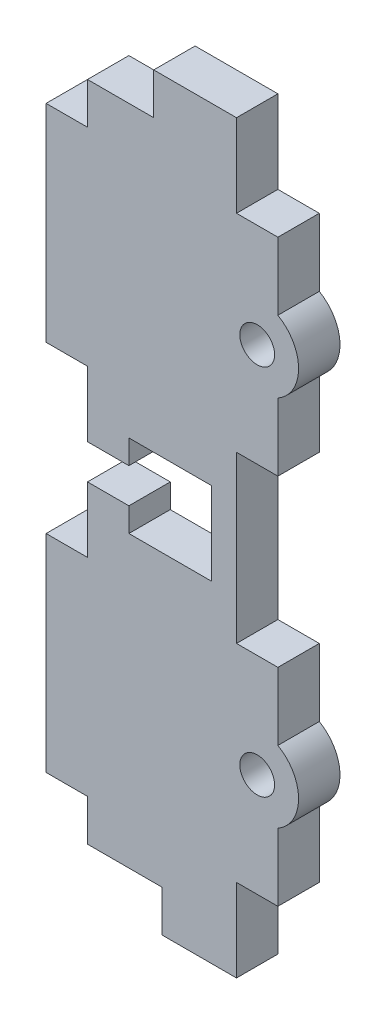
ISO-10303-21;
HEADER;
FILE_DESCRIPTION(('STEP AP214'),'2;1');
FILE_NAME('part.step','',(''),(''),'','','');
FILE_SCHEMA(('AUTOMOTIVE_DESIGN { 1 0 10303 214 1 1 1 1 }'));
ENDSEC;
DATA;
#1=APPLICATION_CONTEXT('core data for automotive mechanical design processes');
#2=APPLICATION_PROTOCOL_DEFINITION('international standard','automotive_design',2000,#1);
#3=PRODUCT_CONTEXT('',#1,'mechanical');
#4=PRODUCT('Part','Part','',(#3));
#5=PRODUCT_RELATED_PRODUCT_CATEGORY('part','',(#4));
#6=PRODUCT_DEFINITION_FORMATION('','',#4);
#7=PRODUCT_DEFINITION_CONTEXT('part definition',#1,'design');
#8=PRODUCT_DEFINITION('design','',#6,#7);
#9=PRODUCT_DEFINITION_SHAPE('','',#8);
#10=(LENGTH_UNIT() NAMED_UNIT(*) SI_UNIT(.MILLI.,.METRE.));
#11=(NAMED_UNIT(*) PLANE_ANGLE_UNIT() SI_UNIT($,.RADIAN.));
#12=(NAMED_UNIT(*) SI_UNIT($,.STERADIAN.) SOLID_ANGLE_UNIT());
#13=UNCERTAINTY_MEASURE_WITH_UNIT(LENGTH_MEASURE(1.E-05),#10,'distance_accuracy_value','');
#14=(GEOMETRIC_REPRESENTATION_CONTEXT(3) GLOBAL_UNCERTAINTY_ASSIGNED_CONTEXT((#13)) GLOBAL_UNIT_ASSIGNED_CONTEXT((#10,
#11,#12)) REPRESENTATION_CONTEXT('',''));
#15=CARTESIAN_POINT('',(0.,0.,0.));
#16=DIRECTION('',(0.,0.,1.));
#17=DIRECTION('',(1.,0.,0.));
#18=AXIS2_PLACEMENT_3D('',#15,#16,#17);
#19=CARTESIAN_POINT('',(-18.,0.,5.));
#20=DIRECTION('',(1.,0.,0.));
#21=DIRECTION('',(0.,0.,-1.));
#22=AXIS2_PLACEMENT_3D('',#19,#20,#21);
#23=PLANE('',#22);
#24=DIRECTION('',(0.,0.,1.));
#25=VECTOR('',#24,1.);
#26=CARTESIAN_POINT('',(-18.,42.1,0.));
#27=LINE('',#26,#25);
#28=CARTESIAN_POINT('',(-18.,42.1,0.));
#29=VERTEX_POINT('',#28);
#30=CARTESIAN_POINT('',(-18.,42.1,5.));
#31=VERTEX_POINT('',#30);
#32=EDGE_CURVE('E324',#29,#31,#27,.T.);
#33=ORIENTED_EDGE('',*,*,#32,.T.);
#34=DIRECTION('',(0.,-1.,0.));
#35=VECTOR('',#34,1.);
#36=CARTESIAN_POINT('',(-18.,0.,5.));
#37=LINE('',#36,#35);
#38=CARTESIAN_POINT('',(-18.,50.,5.));
#39=VERTEX_POINT('',#38);
#40=EDGE_CURVE('E529',#39,#31,#37,.T.);
#41=ORIENTED_EDGE('',*,*,#40,.F.);
#42=DIRECTION('',(0.,0.,-1.));
#43=VECTOR('',#42,1.);
#44=CARTESIAN_POINT('',(-18.,50.,5.));
#45=LINE('',#44,#43);
#46=CARTESIAN_POINT('',(-18.,50.,0.));
#47=VERTEX_POINT('',#46);
#48=EDGE_CURVE('E423',#39,#47,#45,.T.);
#49=ORIENTED_EDGE('',*,*,#48,.T.);
#50=DIRECTION('',(0.,-1.,0.));
#51=VECTOR('',#50,1.);
#52=CARTESIAN_POINT('',(-18.,0.,0.));
#53=LINE('',#52,#51);
#54=EDGE_CURVE('E542',#47,#29,#53,.T.);
#55=ORIENTED_EDGE('',*,*,#54,.T.);
#56=EDGE_LOOP('',(#33,#41,#49,#55));
#57=FACE_BOUND('',#56,.T.);
#58=ADVANCED_FACE('F34',(#57),#23,.F.);
#59=CARTESIAN_POINT('',(5.,4.99999999999999,5.));
#60=DIRECTION('',(1.,0.,0.));
#61=DIRECTION('',(0.,1.,0.));
#62=AXIS2_PLACEMENT_3D('',#59,#60,#61);
#63=PLANE('',#62);
#64=DIRECTION('',(0.,0.,-1.));
#65=VECTOR('',#64,1.);
#66=CARTESIAN_POINT('',(5.,13.1698729810778,5.));
#67=LINE('',#66,#65);
#68=CARTESIAN_POINT('',(5.,13.1698729810778,5.));
#69=VERTEX_POINT('',#68);
#70=CARTESIAN_POINT('',(5.,13.1698729810778,0.));
#71=VERTEX_POINT('',#70);
#72=EDGE_CURVE('E332',#69,#71,#67,.T.);
#73=ORIENTED_EDGE('',*,*,#72,.F.);
#74=DIRECTION('',(0.,-1.,0.));
#75=VECTOR('',#74,1.);
#76=CARTESIAN_POINT('',(5.,4.99999999999999,5.));
#77=LINE('',#76,#75);
#78=CARTESIAN_POINT('',(5.,4.99999999999999,5.));
#79=VERTEX_POINT('',#78);
#80=EDGE_CURVE('E459',#69,#79,#77,.T.);
#81=ORIENTED_EDGE('',*,*,#80,.T.);
#82=DIRECTION('',(0.,0.,-1.));
#83=VECTOR('',#82,1.);
#84=CARTESIAN_POINT('',(5.,4.99999999999999,5.));
#85=LINE('',#84,#83);
#86=CARTESIAN_POINT('',(5.,4.99999999999999,0.));
#87=VERTEX_POINT('',#86);
#88=EDGE_CURVE('E479',#79,#87,#85,.T.);
#89=ORIENTED_EDGE('',*,*,#88,.T.);
#90=DIRECTION('',(0.,-1.,0.));
#91=VECTOR('',#90,1.);
#92=CARTESIAN_POINT('',(5.,4.99999999999999,0.));
#93=LINE('',#92,#91);
#94=EDGE_CURVE('E470',#71,#87,#93,.T.);
#95=ORIENTED_EDGE('',*,*,#94,.F.);
#96=EDGE_LOOP('',(#73,#81,#89,#95));
#97=FACE_BOUND('',#96,.T.);
#98=ADVANCED_FACE('F636',(#97),#63,.T.);
#99=CARTESIAN_POINT('',(5.,75.,5.));
#100=DIRECTION('',(1.,0.,0.));
#101=DIRECTION('',(0.,1.,0.));
#102=AXIS2_PLACEMENT_3D('',#99,#100,#101);
#103=PLANE('',#102);
#104=DIRECTION('',(0.,0.,-1.));
#105=VECTOR('',#104,1.);
#106=CARTESIAN_POINT('',(5.,58.1698729810778,5.));
#107=LINE('',#106,#105);
#108=CARTESIAN_POINT('',(5.,58.1698729810778,5.));
#109=VERTEX_POINT('',#108);
#110=CARTESIAN_POINT('',(5.,58.1698729810778,0.));
#111=VERTEX_POINT('',#110);
#112=EDGE_CURVE('E341',#109,#111,#107,.T.);
#113=ORIENTED_EDGE('',*,*,#112,.F.);
#114=DIRECTION('',(0.,-1.,0.));
#115=VECTOR('',#114,1.);
#116=CARTESIAN_POINT('',(5.,75.,5.));
#117=LINE('',#116,#115);
#118=CARTESIAN_POINT('',(5.,50.,5.));
#119=VERTEX_POINT('',#118);
#120=EDGE_CURVE('E489',#109,#119,#117,.T.);
#121=ORIENTED_EDGE('',*,*,#120,.T.);
#122=DIRECTION('',(0.,0.,-1.));
#123=VECTOR('',#122,1.);
#124=CARTESIAN_POINT('',(5.,50.,5.));
#125=LINE('',#124,#123);
#126=CARTESIAN_POINT('',(5.,50.,0.));
#127=VERTEX_POINT('',#126);
#128=EDGE_CURVE('E510',#119,#127,#125,.T.);
#129=ORIENTED_EDGE('',*,*,#128,.T.);
#130=DIRECTION('',(0.,-1.,0.));
#131=VECTOR('',#130,1.);
#132=CARTESIAN_POINT('',(5.,75.,0.));
#133=LINE('',#132,#131);
#134=EDGE_CURVE('E500',#111,#127,#133,.T.);
#135=ORIENTED_EDGE('',*,*,#134,.F.);
#136=EDGE_LOOP('',(#113,#121,#129,#135));
#137=FACE_BOUND('',#136,.T.);
#138=ADVANCED_FACE('F618',(#137),#103,.T.);
#139=CARTESIAN_POINT('',(0.,0.,5.));
#140=DIRECTION('',(0.,1.,0.));
#141=DIRECTION('',(-1.,0.,0.));
#142=AXIS2_PLACEMENT_3D('',#139,#140,#141);
#143=PLANE('',#142);
#144=DIRECTION('',(0.,0.,-1.));
#145=VECTOR('',#144,1.);
#146=CARTESIAN_POINT('',(-9.,0.,0.));
#147=LINE('',#146,#145);
#148=CARTESIAN_POINT('',(-9.,0.,5.));
#149=VERTEX_POINT('',#148);
#150=CARTESIAN_POINT('',(-9.,0.,0.));
#151=VERTEX_POINT('',#150);
#152=EDGE_CURVE('E376',#149,#151,#147,.T.);
#153=ORIENTED_EDGE('',*,*,#152,.F.);
#154=DIRECTION('',(1.,0.,0.));
#155=VECTOR('',#154,1.);
#156=CARTESIAN_POINT('',(0.,0.,5.));
#157=LINE('',#156,#155);
#158=CARTESIAN_POINT('',(-18.,0.,5.));
#159=VERTEX_POINT('',#158);
#160=EDGE_CURVE('E528',#159,#149,#157,.T.);
#161=ORIENTED_EDGE('',*,*,#160,.F.);
#162=DIRECTION('',(0.,0.,-1.));
#163=VECTOR('',#162,1.);
#164=CARTESIAN_POINT('',(-18.,0.,5.));
#165=LINE('',#164,#163);
#166=CARTESIAN_POINT('',(-18.,0.,0.));
#167=VERTEX_POINT('',#166);
#168=EDGE_CURVE('E42',#159,#167,#165,.T.);
#169=ORIENTED_EDGE('',*,*,#168,.T.);
#170=DIRECTION('',(1.,0.,0.));
#171=VECTOR('',#170,1.);
#172=CARTESIAN_POINT('',(0.,0.,0.));
#173=LINE('',#172,#171);
#174=EDGE_CURVE('E541',#167,#151,#173,.T.);
#175=ORIENTED_EDGE('',*,*,#174,.T.);
#176=EDGE_LOOP('',(#153,#161,#169,#175));
#177=FACE_BOUND('',#176,.T.);
#178=ADVANCED_FACE('F549',(#177),#143,.F.);
#179=CARTESIAN_POINT('',(-18.,80.,0.));
#180=VERTEX_POINT('',#179);
#181=CARTESIAN_POINT('',(-18.,75.,0.));
#182=VERTEX_POINT('',#181);
#183=EDGE_CURVE('E539',#180,#182,#53,.T.);
#184=ORIENTED_EDGE('',*,*,#183,.T.);
#185=DIRECTION('',(0.,0.,-1.));
#186=VECTOR('',#185,1.);
#187=CARTESIAN_POINT('',(-18.,75.,5.));
#188=LINE('',#187,#186);
#189=CARTESIAN_POINT('',(-18.,75.,5.));
#190=VERTEX_POINT('',#189);
#191=EDGE_CURVE('E410',#190,#182,#188,.T.);
#192=ORIENTED_EDGE('',*,*,#191,.F.);
#193=CARTESIAN_POINT('',(-18.,80.,5.));
#194=VERTEX_POINT('',#193);
#195=EDGE_CURVE('E525',#194,#190,#37,.T.);
#196=ORIENTED_EDGE('',*,*,#195,.F.);
#197=DIRECTION('',(0.,0.,-1.));
#198=VECTOR('',#197,1.);
#199=CARTESIAN_POINT('',(-18.,80.,5.));
#200=LINE('',#199,#198);
#201=EDGE_CURVE('E11',#194,#180,#200,.T.);
#202=ORIENTED_EDGE('',*,*,#201,.T.);
#203=EDGE_LOOP('',(#184,#192,#196,#202));
#204=FACE_BOUND('',#203,.T.);
#205=ADVANCED_FACE('F587',(#204),#23,.F.);
#206=CARTESIAN_POINT('',(-18.,37.9,5.));
#207=VERTEX_POINT('',#206);
#208=CARTESIAN_POINT('',(-18.,30.,5.));
#209=VERTEX_POINT('',#208);
#210=EDGE_CURVE('E530',#207,#209,#37,.T.);
#211=ORIENTED_EDGE('',*,*,#210,.F.);
#212=DIRECTION('',(0.,0.,1.));
#213=VECTOR('',#212,1.);
#214=CARTESIAN_POINT('',(-18.,37.9,0.));
#215=LINE('',#214,#213);
#216=CARTESIAN_POINT('',(-18.,37.9,0.));
#217=VERTEX_POINT('',#216);
#218=EDGE_CURVE('E322',#217,#207,#215,.T.);
#219=ORIENTED_EDGE('',*,*,#218,.F.);
#220=CARTESIAN_POINT('',(-18.,30.,0.));
#221=VERTEX_POINT('',#220);
#222=EDGE_CURVE('E543',#217,#221,#53,.T.);
#223=ORIENTED_EDGE('',*,*,#222,.T.);
#224=DIRECTION('',(0.,0.,-1.));
#225=VECTOR('',#224,1.);
#226=CARTESIAN_POINT('',(-18.,30.,5.));
#227=LINE('',#226,#225);
#228=EDGE_CURVE('E450',#209,#221,#227,.T.);
#229=ORIENTED_EDGE('',*,*,#228,.F.);
#230=EDGE_LOOP('',(#211,#219,#223,#229));
#231=FACE_BOUND('',#230,.T.);
#232=ADVANCED_FACE('F647',(#231),#23,.F.);
#233=CARTESIAN_POINT('',(0.,0.,5.));
#234=DIRECTION('',(-1.,0.,0.));
#235=DIRECTION('',(0.,0.,1.));
#236=AXIS2_PLACEMENT_3D('',#233,#234,#235);
#237=PLANE('',#236);
#238=DIRECTION('',(0.,1.,0.));
#239=VECTOR('',#238,1.);
#240=CARTESIAN_POINT('',(0.,0.,0.));
#241=LINE('',#240,#239);
#242=CARTESIAN_POINT('',(0.,-5.,0.));
#243=VERTEX_POINT('',#242);
#244=CARTESIAN_POINT('',(0.,4.99999999999999,0.));
#245=VERTEX_POINT('',#244);
#246=EDGE_CURVE('E533',#243,#245,#241,.T.);
#247=ORIENTED_EDGE('',*,*,#246,.T.);
#248=DIRECTION('',(0.,0.,-1.));
#249=VECTOR('',#248,1.);
#250=CARTESIAN_POINT('',(0.,4.99999999999999,5.));
#251=LINE('',#250,#249);
#252=CARTESIAN_POINT('',(0.,4.99999999999999,5.));
#253=VERTEX_POINT('',#252);
#254=EDGE_CURVE('E475',#253,#245,#251,.T.);
#255=ORIENTED_EDGE('',*,*,#254,.F.);
#256=DIRECTION('',(0.,1.,0.));
#257=VECTOR('',#256,1.);
#258=CARTESIAN_POINT('',(0.,0.,5.));
#259=LINE('',#258,#257);
#260=CARTESIAN_POINT('',(0.,-5.,5.));
#261=VERTEX_POINT('',#260);
#262=EDGE_CURVE('E517',#261,#253,#259,.T.);
#263=ORIENTED_EDGE('',*,*,#262,.F.);
#264=DIRECTION('',(0.,0.,1.));
#265=VECTOR('',#264,1.);
#266=CARTESIAN_POINT('',(0.,-5.,0.));
#267=LINE('',#266,#265);
#268=EDGE_CURVE('E381',#243,#261,#267,.T.);
#269=ORIENTED_EDGE('',*,*,#268,.F.);
#270=EDGE_LOOP('',(#247,#255,#263,#269));
#271=FACE_BOUND('',#270,.T.);
#272=ADVANCED_FACE('F645',(#271),#237,.F.);
#273=CARTESIAN_POINT('',(0.,30.,5.));
#274=VERTEX_POINT('',#273);
#275=CARTESIAN_POINT('',(0.,50.,5.));
#276=VERTEX_POINT('',#275);
#277=EDGE_CURVE('E521',#274,#276,#259,.T.);
#278=ORIENTED_EDGE('',*,*,#277,.F.);
#279=DIRECTION('',(0.,0.,-1.));
#280=VECTOR('',#279,1.);
#281=CARTESIAN_POINT('',(0.,30.,5.));
#282=LINE('',#281,#280);
#283=CARTESIAN_POINT('',(0.,30.,0.));
#284=VERTEX_POINT('',#283);
#285=EDGE_CURVE('E467',#274,#284,#282,.T.);
#286=ORIENTED_EDGE('',*,*,#285,.T.);
#287=CARTESIAN_POINT('',(0.,50.,0.));
#288=VERTEX_POINT('',#287);
#289=EDGE_CURVE('E536',#284,#288,#241,.T.);
#290=ORIENTED_EDGE('',*,*,#289,.T.);
#291=DIRECTION('',(0.,0.,-1.));
#292=VECTOR('',#291,1.);
#293=CARTESIAN_POINT('',(0.,50.,5.));
#294=LINE('',#293,#292);
#295=EDGE_CURVE('E506',#276,#288,#294,.T.);
#296=ORIENTED_EDGE('',*,*,#295,.F.);
#297=EDGE_LOOP('',(#278,#286,#290,#296));
#298=FACE_BOUND('',#297,.T.);
#299=ADVANCED_FACE('F607',(#298),#237,.F.);
#300=CARTESIAN_POINT('',(0.,75.,5.));
#301=VERTEX_POINT('',#300);
#302=CARTESIAN_POINT('',(0.,85.,5.));
#303=VERTEX_POINT('',#302);
#304=EDGE_CURVE('E522',#301,#303,#259,.T.);
#305=ORIENTED_EDGE('',*,*,#304,.F.);
#306=DIRECTION('',(0.,0.,-1.));
#307=VECTOR('',#306,1.);
#308=CARTESIAN_POINT('',(0.,75.,5.));
#309=LINE('',#308,#307);
#310=CARTESIAN_POINT('',(0.,75.,0.));
#311=VERTEX_POINT('',#310);
#312=EDGE_CURVE('E497',#301,#311,#309,.T.);
#313=ORIENTED_EDGE('',*,*,#312,.T.);
#314=CARTESIAN_POINT('',(0.,85.,0.));
#315=VERTEX_POINT('',#314);
#316=EDGE_CURVE('E509',#311,#315,#241,.T.);
#317=ORIENTED_EDGE('',*,*,#316,.T.);
#318=DIRECTION('',(0.,0.,-1.));
#319=VECTOR('',#318,1.);
#320=CARTESIAN_POINT('',(0.,85.,5.));
#321=LINE('',#320,#319);
#322=EDGE_CURVE('E373',#303,#315,#321,.T.);
#323=ORIENTED_EDGE('',*,*,#322,.F.);
#324=EDGE_LOOP('',(#305,#313,#317,#323));
#325=FACE_BOUND('',#324,.T.);
#326=ADVANCED_FACE('F36',(#325),#237,.F.);
#327=CARTESIAN_POINT('',(0.,80.,5.));
#328=DIRECTION('',(0.,-1.,0.));
#329=DIRECTION('',(0.,0.,-1.));
#330=AXIS2_PLACEMENT_3D('',#327,#328,#329);
#331=PLANE('',#330);
#332=DIRECTION('',(-1.,0.,0.));
#333=VECTOR('',#332,1.);
#334=CARTESIAN_POINT('',(0.,80.,5.));
#335=LINE('',#334,#333);
#336=CARTESIAN_POINT('',(-10.,80.,5.));
#337=VERTEX_POINT('',#336);
#338=EDGE_CURVE('E520',#337,#194,#335,.T.);
#339=ORIENTED_EDGE('',*,*,#338,.F.);
#340=DIRECTION('',(0.,0.,-1.));
#341=VECTOR('',#340,1.);
#342=CARTESIAN_POINT('',(-10.,80.,5.));
#343=LINE('',#342,#341);
#344=CARTESIAN_POINT('',(-10.,80.,0.));
#345=VERTEX_POINT('',#344);
#346=EDGE_CURVE('E368',#337,#345,#343,.T.);
#347=ORIENTED_EDGE('',*,*,#346,.T.);
#348=DIRECTION('',(-1.,0.,0.));
#349=VECTOR('',#348,1.);
#350=CARTESIAN_POINT('',(0.,80.,0.));
#351=LINE('',#350,#349);
#352=EDGE_CURVE('E535',#345,#180,#351,.T.);
#353=ORIENTED_EDGE('',*,*,#352,.T.);
#354=ORIENTED_EDGE('',*,*,#201,.F.);
#355=EDGE_LOOP('',(#339,#347,#353,#354));
#356=FACE_BOUND('',#355,.T.);
#357=ADVANCED_FACE('F592',(#356),#331,.F.);
#358=CARTESIAN_POINT('',(-18.,4.99999999999999,5.));
#359=VERTEX_POINT('',#358);
#360=EDGE_CURVE('E524',#359,#159,#37,.T.);
#361=ORIENTED_EDGE('',*,*,#360,.F.);
#362=DIRECTION('',(0.,0.,-1.));
#363=VECTOR('',#362,1.);
#364=CARTESIAN_POINT('',(-18.,4.99999999999999,5.));
#365=LINE('',#364,#363);
#366=CARTESIAN_POINT('',(-18.,4.99999999999999,0.));
#367=VERTEX_POINT('',#366);
#368=EDGE_CURVE('E446',#359,#367,#365,.T.);
#369=ORIENTED_EDGE('',*,*,#368,.T.);
#370=EDGE_CURVE('E538',#367,#167,#53,.T.);
#371=ORIENTED_EDGE('',*,*,#370,.T.);
#372=ORIENTED_EDGE('',*,*,#168,.F.);
#373=EDGE_LOOP('',(#361,#369,#371,#372));
#374=FACE_BOUND('',#373,.T.);
#375=ADVANCED_FACE('F654',(#374),#23,.F.);
#376=CARTESIAN_POINT('',(0.,0.,5.));
#377=DIRECTION('',(0.,0.,1.));
#378=DIRECTION('',(1.,0.,0.));
#379=AXIS2_PLACEMENT_3D('',#376,#377,#378);
#380=PLANE('',#379);
#381=DIRECTION('',(1.,0.,0.));
#382=VECTOR('',#381,1.);
#383=CARTESIAN_POINT('',(0.,37.9,5.));
#384=LINE('',#383,#382);
#385=CARTESIAN_POINT('',(-13.,37.9,5.));
#386=VERTEX_POINT('',#385);
#387=EDGE_CURVE('E313',#207,#386,#384,.T.);
#388=ORIENTED_EDGE('',*,*,#387,.F.);
#389=ORIENTED_EDGE('',*,*,#210,.T.);
#390=DIRECTION('',(1.,0.,0.));
#391=VECTOR('',#390,1.);
#392=CARTESIAN_POINT('',(-18.,30.,5.));
#393=LINE('',#392,#391);
#394=CARTESIAN_POINT('',(-23.,30.,5.));
#395=VERTEX_POINT('',#394);
#396=EDGE_CURVE('E435',#395,#209,#393,.T.);
#397=ORIENTED_EDGE('',*,*,#396,.F.);
#398=DIRECTION('',(0.,1.,0.));
#399=VECTOR('',#398,1.);
#400=CARTESIAN_POINT('',(-23.,4.99999999999999,5.));
#401=LINE('',#400,#399);
#402=CARTESIAN_POINT('',(-23.,4.99999999999999,5.));
#403=VERTEX_POINT('',#402);
#404=EDGE_CURVE('E431',#403,#395,#401,.T.);
#405=ORIENTED_EDGE('',*,*,#404,.F.);
#406=DIRECTION('',(-1.,0.,0.));
#407=VECTOR('',#406,1.);
#408=CARTESIAN_POINT('',(-18.,4.99999999999999,5.));
#409=LINE('',#408,#407);
#410=EDGE_CURVE('E428',#359,#403,#409,.T.);
#411=ORIENTED_EDGE('',*,*,#410,.F.);
#412=ORIENTED_EDGE('',*,*,#360,.T.);
#413=ORIENTED_EDGE('',*,*,#160,.T.);
#414=DIRECTION('',(0.,1.,0.));
#415=VECTOR('',#414,1.);
#416=CARTESIAN_POINT('',(-9.,-5.,5.));
#417=LINE('',#416,#415);
#418=CARTESIAN_POINT('',(-9.,-5.,5.));
#419=VERTEX_POINT('',#418);
#420=EDGE_CURVE('E396',#419,#149,#417,.T.);
#421=ORIENTED_EDGE('',*,*,#420,.F.);
#422=DIRECTION('',(-1.,0.,0.));
#423=VECTOR('',#422,1.);
#424=CARTESIAN_POINT('',(0.,-5.,5.));
#425=LINE('',#424,#423);
#426=EDGE_CURVE('E384',#261,#419,#425,.T.);
#427=ORIENTED_EDGE('',*,*,#426,.F.);
#428=ORIENTED_EDGE('',*,*,#262,.T.);
#429=DIRECTION('',(-1.,0.,0.));
#430=VECTOR('',#429,1.);
#431=CARTESIAN_POINT('',(0.,4.99999999999999,5.));
#432=LINE('',#431,#430);
#433=EDGE_CURVE('E464',#79,#253,#432,.T.);
#434=ORIENTED_EDGE('',*,*,#433,.F.);
#435=ORIENTED_EDGE('',*,*,#80,.F.);
#436=CARTESIAN_POINT('',(2.5,17.5,5.));
#437=DIRECTION('',(0.,0.,-1.));
#438=DIRECTION('',(1.,0.,0.));
#439=AXIS2_PLACEMENT_3D('',#436,#437,#438);
#440=CIRCLE('',#439,5.);
#441=CARTESIAN_POINT('',(5.,21.8301270189222,5.));
#442=VERTEX_POINT('',#441);
#443=EDGE_CURVE('E330',#442,#69,#440,.T.);
#444=ORIENTED_EDGE('',*,*,#443,.F.);
#445=CARTESIAN_POINT('',(5.,30.,5.));
#446=VERTEX_POINT('',#445);
#447=EDGE_CURVE('E461',#446,#442,#77,.T.);
#448=ORIENTED_EDGE('',*,*,#447,.F.);
#449=DIRECTION('',(1.,0.,0.));
#450=VECTOR('',#449,1.);
#451=CARTESIAN_POINT('',(0.,30.,5.));
#452=LINE('',#451,#450);
#453=EDGE_CURVE('E456',#274,#446,#452,.T.);
#454=ORIENTED_EDGE('',*,*,#453,.F.);
#455=ORIENTED_EDGE('',*,*,#277,.T.);
#456=DIRECTION('',(-1.,0.,0.));
#457=VECTOR('',#456,1.);
#458=CARTESIAN_POINT('',(0.,50.,5.));
#459=LINE('',#458,#457);
#460=EDGE_CURVE('E494',#119,#276,#459,.T.);
#461=ORIENTED_EDGE('',*,*,#460,.F.);
#462=ORIENTED_EDGE('',*,*,#120,.F.);
#463=CARTESIAN_POINT('',(2.5,62.5,5.));
#464=DIRECTION('',(0.,0.,-1.));
#465=DIRECTION('',(-1.,0.,0.));
#466=AXIS2_PLACEMENT_3D('',#463,#464,#465);
#467=CIRCLE('',#466,5.);
#468=CARTESIAN_POINT('',(5.,66.8301270189222,5.));
#469=VERTEX_POINT('',#468);
#470=EDGE_CURVE('E339',#469,#109,#467,.T.);
#471=ORIENTED_EDGE('',*,*,#470,.F.);
#472=CARTESIAN_POINT('',(5.,75.,5.));
#473=VERTEX_POINT('',#472);
#474=EDGE_CURVE('E491',#473,#469,#117,.T.);
#475=ORIENTED_EDGE('',*,*,#474,.F.);
#476=DIRECTION('',(1.,0.,0.));
#477=VECTOR('',#476,1.);
#478=CARTESIAN_POINT('',(0.,75.,5.));
#479=LINE('',#478,#477);
#480=EDGE_CURVE('E486',#301,#473,#479,.T.);
#481=ORIENTED_EDGE('',*,*,#480,.F.);
#482=ORIENTED_EDGE('',*,*,#304,.T.);
#483=DIRECTION('',(1.,0.,0.));
#484=VECTOR('',#483,1.);
#485=CARTESIAN_POINT('',(0.,85.,5.));
#486=LINE('',#485,#484);
#487=CARTESIAN_POINT('',(-10.,85.,5.));
#488=VERTEX_POINT('',#487);
#489=EDGE_CURVE('E364',#488,#303,#486,.T.);
#490=ORIENTED_EDGE('',*,*,#489,.F.);
#491=DIRECTION('',(0.,1.,0.));
#492=VECTOR('',#491,1.);
#493=CARTESIAN_POINT('',(-10.,80.,5.));
#494=LINE('',#493,#492);
#495=EDGE_CURVE('E361',#337,#488,#494,.T.);
#496=ORIENTED_EDGE('',*,*,#495,.F.);
#497=ORIENTED_EDGE('',*,*,#338,.T.);
#498=ORIENTED_EDGE('',*,*,#195,.T.);
#499=DIRECTION('',(1.,0.,0.));
#500=VECTOR('',#499,1.);
#501=CARTESIAN_POINT('',(-18.,75.,5.));
#502=LINE('',#501,#500);
#503=CARTESIAN_POINT('',(-23.,75.,5.));
#504=VERTEX_POINT('',#503);
#505=EDGE_CURVE('E400',#504,#190,#502,.T.);
#506=ORIENTED_EDGE('',*,*,#505,.F.);
#507=DIRECTION('',(0.,1.,0.));
#508=VECTOR('',#507,1.);
#509=CARTESIAN_POINT('',(-23.,75.,5.));
#510=LINE('',#509,#508);
#511=CARTESIAN_POINT('',(-23.,50.,5.));
#512=VERTEX_POINT('',#511);
#513=EDGE_CURVE('E407',#512,#504,#510,.T.);
#514=ORIENTED_EDGE('',*,*,#513,.F.);
#515=DIRECTION('',(-1.,0.,0.));
#516=VECTOR('',#515,1.);
#517=CARTESIAN_POINT('',(-18.,50.,5.));
#518=LINE('',#517,#516);
#519=EDGE_CURVE('E403',#39,#512,#518,.T.);
#520=ORIENTED_EDGE('',*,*,#519,.F.);
#521=ORIENTED_EDGE('',*,*,#40,.T.);
#522=DIRECTION('',(1.,0.,0.));
#523=VECTOR('',#522,1.);
#524=CARTESIAN_POINT('',(0.,42.1,5.));
#525=LINE('',#524,#523);
#526=CARTESIAN_POINT('',(-13.,42.1,5.));
#527=VERTEX_POINT('',#526);
#528=EDGE_CURVE('E310',#31,#527,#525,.T.);
#529=ORIENTED_EDGE('',*,*,#528,.T.);
#530=DIRECTION('',(0.,-1.,0.));
#531=VECTOR('',#530,1.);
#532=CARTESIAN_POINT('',(-13.,0.,5.));
#533=LINE('',#532,#531);
#534=CARTESIAN_POINT('',(-13.,45.,5.));
#535=VERTEX_POINT('',#534);
#536=EDGE_CURVE('E307',#535,#527,#533,.T.);
#537=ORIENTED_EDGE('',*,*,#536,.F.);
#538=DIRECTION('',(1.,0.,0.));
#539=VECTOR('',#538,1.);
#540=CARTESIAN_POINT('',(0.,45.,5.));
#541=LINE('',#540,#539);
#542=CARTESIAN_POINT('',(-3.,45.,5.));
#543=VERTEX_POINT('',#542);
#544=EDGE_CURVE('E305',#535,#543,#541,.T.);
#545=ORIENTED_EDGE('',*,*,#544,.T.);
#546=DIRECTION('',(0.,-1.,0.));
#547=VECTOR('',#546,1.);
#548=CARTESIAN_POINT('',(-3.,0.,5.));
#549=LINE('',#548,#547);
#550=CARTESIAN_POINT('',(-3.,35.,5.));
#551=VERTEX_POINT('',#550);
#552=EDGE_CURVE('E281',#543,#551,#549,.T.);
#553=ORIENTED_EDGE('',*,*,#552,.T.);
#554=DIRECTION('',(1.,0.,0.));
#555=VECTOR('',#554,1.);
#556=CARTESIAN_POINT('',(0.,35.,5.));
#557=LINE('',#556,#555);
#558=CARTESIAN_POINT('',(-13.,35.,5.));
#559=VERTEX_POINT('',#558);
#560=EDGE_CURVE('E290',#559,#551,#557,.T.);
#561=ORIENTED_EDGE('',*,*,#560,.F.);
#562=EDGE_CURVE('E293',#386,#559,#533,.T.);
#563=ORIENTED_EDGE('',*,*,#562,.F.);
#564=EDGE_LOOP('',(#388,#389,#397,#405,#411,#412,#413,#421,#427,#428,#434,#435,#444,#448,#454,
#455,#461,#462,#471,#475,#481,#482,#490,#496,#497,#498,#506,#514,#520,#521,#529,#537,#545,#553,
#561,#563));
#565=FACE_BOUND('',#564,.T.);
#566=CARTESIAN_POINT('',(2.5,62.5,5.));
#567=DIRECTION('',(0.,0.,-1.));
#568=DIRECTION('',(-1.,0.,0.));
#569=AXIS2_PLACEMENT_3D('',#566,#567,#568);
#570=CIRCLE('',#569,2.1);
#571=CARTESIAN_POINT('',(0.399999999999998,62.5,5.));
#572=VERTEX_POINT('',#571);
#573=EDGE_CURVE('E349',#572,#572,#570,.T.);
#574=ORIENTED_EDGE('',*,*,#573,.T.);
#575=EDGE_LOOP('',(#574));
#576=FACE_BOUND('',#575,.T.);
#577=CARTESIAN_POINT('',(2.5,17.5,5.));
#578=DIRECTION('',(0.,0.,-1.));
#579=DIRECTION('',(1.,0.,0.));
#580=AXIS2_PLACEMENT_3D('',#577,#578,#579);
#581=CIRCLE('',#580,2.1);
#582=CARTESIAN_POINT('',(4.6,17.5,5.));
#583=VERTEX_POINT('',#582);
#584=EDGE_CURVE('E356',#583,#583,#581,.T.);
#585=ORIENTED_EDGE('',*,*,#584,.T.);
#586=EDGE_LOOP('',(#585));
#587=FACE_BOUND('',#586,.T.);
#588=ADVANCED_FACE('F561',(#565,#576,#587),#380,.T.);
#589=CARTESIAN_POINT('',(0.,0.,0.));
#590=DIRECTION('',(0.,0.,1.));
#591=DIRECTION('',(1.,0.,0.));
#592=AXIS2_PLACEMENT_3D('',#589,#590,#591);
#593=PLANE('',#592);
#594=CARTESIAN_POINT('',(2.5,62.5,0.));
#595=DIRECTION('',(0.,0.,-1.));
#596=DIRECTION('',(-1.,0.,0.));
#597=AXIS2_PLACEMENT_3D('',#594,#595,#596);
#598=CIRCLE('',#597,2.1);
#599=CARTESIAN_POINT('',(0.399999999999998,62.5,0.));
#600=VERTEX_POINT('',#599);
#601=EDGE_CURVE('E353',#600,#600,#598,.T.);
#602=ORIENTED_EDGE('',*,*,#601,.F.);
#603=EDGE_LOOP('',(#602));
#604=FACE_BOUND('',#603,.T.);
#605=CARTESIAN_POINT('',(2.5,17.5,0.));
#606=DIRECTION('',(0.,0.,-1.));
#607=DIRECTION('',(1.,0.,0.));
#608=AXIS2_PLACEMENT_3D('',#605,#606,#607);
#609=CIRCLE('',#608,2.1);
#610=CARTESIAN_POINT('',(4.6,17.5,0.));
#611=VERTEX_POINT('',#610);
#612=EDGE_CURVE('E346',#611,#611,#609,.T.);
#613=ORIENTED_EDGE('',*,*,#612,.F.);
#614=EDGE_LOOP('',(#613));
#615=FACE_BOUND('',#614,.T.);
#616=ORIENTED_EDGE('',*,*,#222,.F.);
#617=DIRECTION('',(1.,0.,0.));
#618=VECTOR('',#617,1.);
#619=CARTESIAN_POINT('',(0.,37.9,0.));
#620=LINE('',#619,#618);
#621=CARTESIAN_POINT('',(-13.,37.9,0.));
#622=VERTEX_POINT('',#621);
#623=EDGE_CURVE('E300',#217,#622,#620,.T.);
#624=ORIENTED_EDGE('',*,*,#623,.T.);
#625=DIRECTION('',(0.,-1.,0.));
#626=VECTOR('',#625,1.);
#627=CARTESIAN_POINT('',(-13.,0.,0.));
#628=LINE('',#627,#626);
#629=CARTESIAN_POINT('',(-13.,35.,0.));
#630=VERTEX_POINT('',#629);
#631=EDGE_CURVE('E298',#622,#630,#628,.T.);
#632=ORIENTED_EDGE('',*,*,#631,.T.);
#633=DIRECTION('',(1.,0.,0.));
#634=VECTOR('',#633,1.);
#635=CARTESIAN_POINT('',(0.,35.,0.));
#636=LINE('',#635,#634);
#637=CARTESIAN_POINT('',(-3.,35.,0.));
#638=VERTEX_POINT('',#637);
#639=EDGE_CURVE('E283',#630,#638,#636,.T.);
#640=ORIENTED_EDGE('',*,*,#639,.T.);
#641=DIRECTION('',(0.,-1.,0.));
#642=VECTOR('',#641,1.);
#643=CARTESIAN_POINT('',(-3.,0.,0.));
#644=LINE('',#643,#642);
#645=CARTESIAN_POINT('',(-3.,45.,0.));
#646=VERTEX_POINT('',#645);
#647=EDGE_CURVE('E275',#646,#638,#644,.T.);
#648=ORIENTED_EDGE('',*,*,#647,.F.);
#649=DIRECTION('',(1.,0.,0.));
#650=VECTOR('',#649,1.);
#651=CARTESIAN_POINT('',(0.,45.,0.));
#652=LINE('',#651,#650);
#653=CARTESIAN_POINT('',(-13.,45.,0.));
#654=VERTEX_POINT('',#653);
#655=EDGE_CURVE('E267',#654,#646,#652,.T.);
#656=ORIENTED_EDGE('',*,*,#655,.F.);
#657=CARTESIAN_POINT('',(-13.,42.1,0.));
#658=VERTEX_POINT('',#657);
#659=EDGE_CURVE('E49',#654,#658,#628,.T.);
#660=ORIENTED_EDGE('',*,*,#659,.T.);
#661=DIRECTION('',(1.,0.,0.));
#662=VECTOR('',#661,1.);
#663=CARTESIAN_POINT('',(0.,42.1,0.));
#664=LINE('',#663,#662);
#665=EDGE_CURVE('E297',#29,#658,#664,.T.);
#666=ORIENTED_EDGE('',*,*,#665,.F.);
#667=ORIENTED_EDGE('',*,*,#54,.F.);
#668=DIRECTION('',(-1.,0.,0.));
#669=VECTOR('',#668,1.);
#670=CARTESIAN_POINT('',(-18.,50.,0.));
#671=LINE('',#670,#669);
#672=CARTESIAN_POINT('',(-23.,50.,0.));
#673=VERTEX_POINT('',#672);
#674=EDGE_CURVE('E413',#47,#673,#671,.T.);
#675=ORIENTED_EDGE('',*,*,#674,.T.);
#676=DIRECTION('',(0.,1.,0.));
#677=VECTOR('',#676,1.);
#678=CARTESIAN_POINT('',(-23.,75.,0.));
#679=LINE('',#678,#677);
#680=CARTESIAN_POINT('',(-23.,75.,0.));
#681=VERTEX_POINT('',#680);
#682=EDGE_CURVE('E404',#673,#681,#679,.T.);
#683=ORIENTED_EDGE('',*,*,#682,.T.);
#684=DIRECTION('',(1.,0.,0.));
#685=VECTOR('',#684,1.);
#686=CARTESIAN_POINT('',(-18.,75.,0.));
#687=LINE('',#686,#685);
#688=EDGE_CURVE('E399',#681,#182,#687,.T.);
#689=ORIENTED_EDGE('',*,*,#688,.T.);
#690=ORIENTED_EDGE('',*,*,#183,.F.);
#691=ORIENTED_EDGE('',*,*,#352,.F.);
#692=DIRECTION('',(0.,1.,0.));
#693=VECTOR('',#692,1.);
#694=CARTESIAN_POINT('',(-10.,80.,0.));
#695=LINE('',#694,#693);
#696=CARTESIAN_POINT('',(-10.,85.,0.));
#697=VERTEX_POINT('',#696);
#698=EDGE_CURVE('E352',#345,#697,#695,.T.);
#699=ORIENTED_EDGE('',*,*,#698,.T.);
#700=DIRECTION('',(1.,0.,0.));
#701=VECTOR('',#700,1.);
#702=CARTESIAN_POINT('',(0.,85.,0.));
#703=LINE('',#702,#701);
#704=EDGE_CURVE('E365',#697,#315,#703,.T.);
#705=ORIENTED_EDGE('',*,*,#704,.T.);
#706=ORIENTED_EDGE('',*,*,#316,.F.);
#707=DIRECTION('',(1.,0.,0.));
#708=VECTOR('',#707,1.);
#709=CARTESIAN_POINT('',(0.,75.,0.));
#710=LINE('',#709,#708);
#711=CARTESIAN_POINT('',(5.,75.,0.));
#712=VERTEX_POINT('',#711);
#713=EDGE_CURVE('E478',#311,#712,#710,.T.);
#714=ORIENTED_EDGE('',*,*,#713,.T.);
#715=CARTESIAN_POINT('',(5.,66.8301270189222,0.));
#716=VERTEX_POINT('',#715);
#717=EDGE_CURVE('E501',#712,#716,#133,.T.);
#718=ORIENTED_EDGE('',*,*,#717,.T.);
#719=CARTESIAN_POINT('',(2.5,62.5,0.));
#720=DIRECTION('',(0.,0.,-1.));
#721=DIRECTION('',(-1.,0.,0.));
#722=AXIS2_PLACEMENT_3D('',#719,#720,#721);
#723=CIRCLE('',#722,5.);
#724=EDGE_CURVE('E337',#716,#111,#723,.T.);
#725=ORIENTED_EDGE('',*,*,#724,.T.);
#726=ORIENTED_EDGE('',*,*,#134,.T.);
#727=DIRECTION('',(-1.,0.,0.));
#728=VECTOR('',#727,1.);
#729=CARTESIAN_POINT('',(0.,50.,0.));
#730=LINE('',#729,#728);
#731=EDGE_CURVE('E490',#127,#288,#730,.T.);
#732=ORIENTED_EDGE('',*,*,#731,.T.);
#733=ORIENTED_EDGE('',*,*,#289,.F.);
#734=DIRECTION('',(1.,0.,0.));
#735=VECTOR('',#734,1.);
#736=CARTESIAN_POINT('',(0.,30.,0.));
#737=LINE('',#736,#735);
#738=CARTESIAN_POINT('',(5.,30.,0.));
#739=VERTEX_POINT('',#738);
#740=EDGE_CURVE('E449',#284,#739,#737,.T.);
#741=ORIENTED_EDGE('',*,*,#740,.T.);
#742=CARTESIAN_POINT('',(5.,21.8301270189222,0.));
#743=VERTEX_POINT('',#742);
#744=EDGE_CURVE('E471',#739,#743,#93,.T.);
#745=ORIENTED_EDGE('',*,*,#744,.T.);
#746=CARTESIAN_POINT('',(2.5,17.5,0.));
#747=DIRECTION('',(0.,0.,-1.));
#748=DIRECTION('',(1.,0.,0.));
#749=AXIS2_PLACEMENT_3D('',#746,#747,#748);
#750=CIRCLE('',#749,5.);
#751=EDGE_CURVE('E57',#743,#71,#750,.T.);
#752=ORIENTED_EDGE('',*,*,#751,.T.);
#753=ORIENTED_EDGE('',*,*,#94,.T.);
#754=DIRECTION('',(-1.,0.,0.));
#755=VECTOR('',#754,1.);
#756=CARTESIAN_POINT('',(0.,4.99999999999999,0.));
#757=LINE('',#756,#755);
#758=EDGE_CURVE('E460',#87,#245,#757,.T.);
#759=ORIENTED_EDGE('',*,*,#758,.T.);
#760=ORIENTED_EDGE('',*,*,#246,.F.);
#761=DIRECTION('',(1.,0.,0.));
#762=VECTOR('',#761,1.);
#763=CARTESIAN_POINT('',(0.,-5.,0.));
#764=LINE('',#763,#762);
#765=CARTESIAN_POINT('',(-9.,-5.,0.));
#766=VERTEX_POINT('',#765);
#767=EDGE_CURVE('E388',#766,#243,#764,.T.);
#768=ORIENTED_EDGE('',*,*,#767,.F.);
#769=DIRECTION('',(0.,1.,0.));
#770=VECTOR('',#769,1.);
#771=CARTESIAN_POINT('',(-9.,-5.,0.));
#772=LINE('',#771,#770);
#773=EDGE_CURVE('E391',#766,#151,#772,.T.);
#774=ORIENTED_EDGE('',*,*,#773,.T.);
#775=ORIENTED_EDGE('',*,*,#174,.F.);
#776=ORIENTED_EDGE('',*,*,#370,.F.);
#777=DIRECTION('',(-1.,0.,0.));
#778=VECTOR('',#777,1.);
#779=CARTESIAN_POINT('',(-18.,4.99999999999999,0.));
#780=LINE('',#779,#778);
#781=CARTESIAN_POINT('',(-23.,4.99999999999999,0.));
#782=VERTEX_POINT('',#781);
#783=EDGE_CURVE('E420',#367,#782,#780,.T.);
#784=ORIENTED_EDGE('',*,*,#783,.T.);
#785=DIRECTION('',(0.,1.,0.));
#786=VECTOR('',#785,1.);
#787=CARTESIAN_POINT('',(-23.,4.99999999999999,0.));
#788=LINE('',#787,#786);
#789=CARTESIAN_POINT('',(-23.,30.,0.));
#790=VERTEX_POINT('',#789);
#791=EDGE_CURVE('E441',#782,#790,#788,.T.);
#792=ORIENTED_EDGE('',*,*,#791,.T.);
#793=DIRECTION('',(1.,0.,0.));
#794=VECTOR('',#793,1.);
#795=CARTESIAN_POINT('',(-18.,30.,0.));
#796=LINE('',#795,#794);
#797=EDGE_CURVE('E432',#790,#221,#796,.T.);
#798=ORIENTED_EDGE('',*,*,#797,.T.);
#799=EDGE_LOOP('',(#616,#624,#632,#640,#648,#656,#660,#666,#667,#675,#683,#689,#690,#691,#699,
#705,#706,#714,#718,#725,#726,#732,#733,#741,#745,#752,#753,#759,#760,#768,#774,#775,#776,#784,
#792,#798));
#800=FACE_BOUND('',#799,.T.);
#801=ADVANCED_FACE('F287',(#604,#615,#800),#593,.F.);
#802=CARTESIAN_POINT('',(0.,50.,5.));
#803=DIRECTION('',(0.,-1.,0.));
#804=DIRECTION('',(0.,0.,-1.));
#805=AXIS2_PLACEMENT_3D('',#802,#803,#804);
#806=PLANE('',#805);
#807=ORIENTED_EDGE('',*,*,#731,.F.);
#808=ORIENTED_EDGE('',*,*,#128,.F.);
#809=ORIENTED_EDGE('',*,*,#460,.T.);
#810=ORIENTED_EDGE('',*,*,#295,.T.);
#811=EDGE_LOOP('',(#807,#808,#809,#810));
#812=FACE_BOUND('',#811,.T.);
#813=ADVANCED_FACE('F612',(#812),#806,.T.);
#814=DIRECTION('',(0.,0.,-1.));
#815=VECTOR('',#814,1.);
#816=CARTESIAN_POINT('',(5.,66.8301270189222,5.));
#817=LINE('',#816,#815);
#818=EDGE_CURVE('E343',#469,#716,#817,.T.);
#819=ORIENTED_EDGE('',*,*,#818,.T.);
#820=ORIENTED_EDGE('',*,*,#717,.F.);
#821=DIRECTION('',(0.,0.,-1.));
#822=VECTOR('',#821,1.);
#823=CARTESIAN_POINT('',(5.,75.,5.));
#824=LINE('',#823,#822);
#825=EDGE_CURVE('E513',#473,#712,#824,.T.);
#826=ORIENTED_EDGE('',*,*,#825,.F.);
#827=ORIENTED_EDGE('',*,*,#474,.T.);
#828=EDGE_LOOP('',(#819,#820,#826,#827));
#829=FACE_BOUND('',#828,.T.);
#830=ADVANCED_FACE('F700',(#829),#103,.T.);
#831=CARTESIAN_POINT('',(0.,75.,5.));
#832=DIRECTION('',(0.,1.,0.));
#833=DIRECTION('',(0.,0.,1.));
#834=AXIS2_PLACEMENT_3D('',#831,#832,#833);
#835=PLANE('',#834);
#836=ORIENTED_EDGE('',*,*,#713,.F.);
#837=ORIENTED_EDGE('',*,*,#312,.F.);
#838=ORIENTED_EDGE('',*,*,#480,.T.);
#839=ORIENTED_EDGE('',*,*,#825,.T.);
#840=EDGE_LOOP('',(#836,#837,#838,#839));
#841=FACE_BOUND('',#840,.T.);
#842=ADVANCED_FACE('F709',(#841),#835,.T.);
#843=CARTESIAN_POINT('',(0.,4.99999999999999,5.));
#844=DIRECTION('',(0.,-1.,0.));
#845=DIRECTION('',(1.,0.,0.));
#846=AXIS2_PLACEMENT_3D('',#843,#844,#845);
#847=PLANE('',#846);
#848=ORIENTED_EDGE('',*,*,#758,.F.);
#849=ORIENTED_EDGE('',*,*,#88,.F.);
#850=ORIENTED_EDGE('',*,*,#433,.T.);
#851=ORIENTED_EDGE('',*,*,#254,.T.);
#852=EDGE_LOOP('',(#848,#849,#850,#851));
#853=FACE_BOUND('',#852,.T.);
#854=ADVANCED_FACE('F640',(#853),#847,.T.);
#855=DIRECTION('',(0.,0.,-1.));
#856=VECTOR('',#855,1.);
#857=CARTESIAN_POINT('',(5.,21.8301270189222,5.));
#858=LINE('',#857,#856);
#859=EDGE_CURVE('E334',#442,#743,#858,.T.);
#860=ORIENTED_EDGE('',*,*,#859,.T.);
#861=ORIENTED_EDGE('',*,*,#744,.F.);
#862=DIRECTION('',(0.,0.,-1.));
#863=VECTOR('',#862,1.);
#864=CARTESIAN_POINT('',(5.,30.,5.));
#865=LINE('',#864,#863);
#866=EDGE_CURVE('E482',#446,#739,#865,.T.);
#867=ORIENTED_EDGE('',*,*,#866,.F.);
#868=ORIENTED_EDGE('',*,*,#447,.T.);
#869=EDGE_LOOP('',(#860,#861,#867,#868));
#870=FACE_BOUND('',#869,.T.);
#871=ADVANCED_FACE('F627',(#870),#63,.T.);
#872=CARTESIAN_POINT('',(0.,30.,5.));
#873=DIRECTION('',(0.,1.,0.));
#874=DIRECTION('',(-1.,0.,0.));
#875=AXIS2_PLACEMENT_3D('',#872,#873,#874);
#876=PLANE('',#875);
#877=ORIENTED_EDGE('',*,*,#740,.F.);
#878=ORIENTED_EDGE('',*,*,#285,.F.);
#879=ORIENTED_EDGE('',*,*,#453,.T.);
#880=ORIENTED_EDGE('',*,*,#866,.T.);
#881=EDGE_LOOP('',(#877,#878,#879,#880));
#882=FACE_BOUND('',#881,.T.);
#883=ADVANCED_FACE('F624',(#882),#876,.T.);
#884=CARTESIAN_POINT('',(-18.,4.99999999999999,5.));
#885=DIRECTION('',(0.,-1.,0.));
#886=DIRECTION('',(1.,0.,0.));
#887=AXIS2_PLACEMENT_3D('',#884,#885,#886);
#888=PLANE('',#887);
#889=ORIENTED_EDGE('',*,*,#783,.F.);
#890=ORIENTED_EDGE('',*,*,#368,.F.);
#891=ORIENTED_EDGE('',*,*,#410,.T.);
#892=DIRECTION('',(0.,0.,-1.));
#893=VECTOR('',#892,1.);
#894=CARTESIAN_POINT('',(-23.,4.99999999999999,5.));
#895=LINE('',#894,#893);
#896=EDGE_CURVE('E438',#403,#782,#895,.T.);
#897=ORIENTED_EDGE('',*,*,#896,.T.);
#898=EDGE_LOOP('',(#889,#890,#891,#897));
#899=FACE_BOUND('',#898,.T.);
#900=ADVANCED_FACE('F733',(#899),#888,.T.);
#901=CARTESIAN_POINT('',(-18.,30.,5.));
#902=DIRECTION('',(0.,1.,0.));
#903=DIRECTION('',(-1.,0.,0.));
#904=AXIS2_PLACEMENT_3D('',#901,#902,#903);
#905=PLANE('',#904);
#906=ORIENTED_EDGE('',*,*,#797,.F.);
#907=DIRECTION('',(0.,0.,-1.));
#908=VECTOR('',#907,1.);
#909=CARTESIAN_POINT('',(-23.,30.,5.));
#910=LINE('',#909,#908);
#911=EDGE_CURVE('E453',#395,#790,#910,.T.);
#912=ORIENTED_EDGE('',*,*,#911,.F.);
#913=ORIENTED_EDGE('',*,*,#396,.T.);
#914=ORIENTED_EDGE('',*,*,#228,.T.);
#915=EDGE_LOOP('',(#906,#912,#913,#914));
#916=FACE_BOUND('',#915,.T.);
#917=ADVANCED_FACE('F742',(#916),#905,.T.);
#918=CARTESIAN_POINT('',(-23.,4.99999999999999,5.));
#919=DIRECTION('',(-1.,0.,0.));
#920=DIRECTION('',(0.,-1.,0.));
#921=AXIS2_PLACEMENT_3D('',#918,#919,#920);
#922=PLANE('',#921);
#923=ORIENTED_EDGE('',*,*,#791,.F.);
#924=ORIENTED_EDGE('',*,*,#896,.F.);
#925=ORIENTED_EDGE('',*,*,#404,.T.);
#926=ORIENTED_EDGE('',*,*,#911,.T.);
#927=EDGE_LOOP('',(#923,#924,#925,#926));
#928=FACE_BOUND('',#927,.T.);
#929=ADVANCED_FACE('F752',(#928),#922,.T.);
#930=CARTESIAN_POINT('',(-18.,75.,5.));
#931=DIRECTION('',(0.,1.,0.));
#932=DIRECTION('',(0.,0.,1.));
#933=AXIS2_PLACEMENT_3D('',#930,#931,#932);
#934=PLANE('',#933);
#935=ORIENTED_EDGE('',*,*,#688,.F.);
#936=DIRECTION('',(0.,0.,-1.));
#937=VECTOR('',#936,1.);
#938=CARTESIAN_POINT('',(-23.,75.,5.));
#939=LINE('',#938,#937);
#940=EDGE_CURVE('E418',#504,#681,#939,.T.);
#941=ORIENTED_EDGE('',*,*,#940,.F.);
#942=ORIENTED_EDGE('',*,*,#505,.T.);
#943=ORIENTED_EDGE('',*,*,#191,.T.);
#944=EDGE_LOOP('',(#935,#941,#942,#943));
#945=FACE_BOUND('',#944,.T.);
#946=ADVANCED_FACE('F583',(#945),#934,.T.);
#947=CARTESIAN_POINT('',(-23.,75.,5.));
#948=DIRECTION('',(-1.,0.,0.));
#949=DIRECTION('',(0.,-1.,0.));
#950=AXIS2_PLACEMENT_3D('',#947,#948,#949);
#951=PLANE('',#950);
#952=ORIENTED_EDGE('',*,*,#682,.F.);
#953=DIRECTION('',(0.,0.,-1.));
#954=VECTOR('',#953,1.);
#955=CARTESIAN_POINT('',(-23.,50.,5.));
#956=LINE('',#955,#954);
#957=EDGE_CURVE('E421',#512,#673,#956,.T.);
#958=ORIENTED_EDGE('',*,*,#957,.F.);
#959=ORIENTED_EDGE('',*,*,#513,.T.);
#960=ORIENTED_EDGE('',*,*,#940,.T.);
#961=EDGE_LOOP('',(#952,#958,#959,#960));
#962=FACE_BOUND('',#961,.T.);
#963=ADVANCED_FACE('F579',(#962),#951,.T.);
#964=CARTESIAN_POINT('',(-18.,50.,5.));
#965=DIRECTION('',(0.,-1.,0.));
#966=DIRECTION('',(0.,0.,-1.));
#967=AXIS2_PLACEMENT_3D('',#964,#965,#966);
#968=PLANE('',#967);
#969=ORIENTED_EDGE('',*,*,#674,.F.);
#970=ORIENTED_EDGE('',*,*,#48,.F.);
#971=ORIENTED_EDGE('',*,*,#519,.T.);
#972=ORIENTED_EDGE('',*,*,#957,.T.);
#973=EDGE_LOOP('',(#969,#970,#971,#972));
#974=FACE_BOUND('',#973,.T.);
#975=ADVANCED_FACE('F575',(#974),#968,.T.);
#976=CARTESIAN_POINT('',(-9.,-5.,0.));
#977=DIRECTION('',(1.,0.,0.));
#978=DIRECTION('',(0.,1.,0.));
#979=AXIS2_PLACEMENT_3D('',#976,#977,#978);
#980=PLANE('',#979);
#981=ORIENTED_EDGE('',*,*,#152,.T.);
#982=ORIENTED_EDGE('',*,*,#773,.F.);
#983=DIRECTION('',(0.,0.,-1.));
#984=VECTOR('',#983,1.);
#985=CARTESIAN_POINT('',(-9.,-5.,0.));
#986=LINE('',#985,#984);
#987=EDGE_CURVE('E386',#419,#766,#986,.T.);
#988=ORIENTED_EDGE('',*,*,#987,.F.);
#989=ORIENTED_EDGE('',*,*,#420,.T.);
#990=EDGE_LOOP('',(#981,#982,#988,#989));
#991=FACE_BOUND('',#990,.T.);
#992=ADVANCED_FACE('F557',(#991),#980,.F.);
#993=CARTESIAN_POINT('',(0.,-5.,0.));
#994=DIRECTION('',(0.,-1.,0.));
#995=DIRECTION('',(1.,0.,0.));
#996=AXIS2_PLACEMENT_3D('',#993,#994,#995);
#997=PLANE('',#996);
#998=ORIENTED_EDGE('',*,*,#268,.T.);
#999=ORIENTED_EDGE('',*,*,#426,.T.);
#1000=ORIENTED_EDGE('',*,*,#987,.T.);
#1001=ORIENTED_EDGE('',*,*,#767,.T.);
#1002=EDGE_LOOP('',(#998,#999,#1000,#1001));
#1003=FACE_BOUND('',#1002,.T.);
#1004=ADVANCED_FACE('F644',(#1003),#997,.T.);
#1005=CARTESIAN_POINT('',(0.,85.,5.));
#1006=DIRECTION('',(0.,1.,0.));
#1007=DIRECTION('',(0.,0.,1.));
#1008=AXIS2_PLACEMENT_3D('',#1005,#1006,#1007);
#1009=PLANE('',#1008);
#1010=ORIENTED_EDGE('',*,*,#704,.F.);
#1011=DIRECTION('',(0.,0.,-1.));
#1012=VECTOR('',#1011,1.);
#1013=CARTESIAN_POINT('',(-10.,85.,5.));
#1014=LINE('',#1013,#1012);
#1015=EDGE_CURVE('E377',#488,#697,#1014,.T.);
#1016=ORIENTED_EDGE('',*,*,#1015,.F.);
#1017=ORIENTED_EDGE('',*,*,#489,.T.);
#1018=ORIENTED_EDGE('',*,*,#322,.T.);
#1019=EDGE_LOOP('',(#1010,#1016,#1017,#1018));
#1020=FACE_BOUND('',#1019,.T.);
#1021=ADVANCED_FACE('F602',(#1020),#1009,.T.);
#1022=CARTESIAN_POINT('',(-10.,80.,5.));
#1023=DIRECTION('',(-1.,0.,0.));
#1024=DIRECTION('',(0.,0.,1.));
#1025=AXIS2_PLACEMENT_3D('',#1022,#1023,#1024);
#1026=PLANE('',#1025);
#1027=ORIENTED_EDGE('',*,*,#698,.F.);
#1028=ORIENTED_EDGE('',*,*,#346,.F.);
#1029=ORIENTED_EDGE('',*,*,#495,.T.);
#1030=ORIENTED_EDGE('',*,*,#1015,.T.);
#1031=EDGE_LOOP('',(#1027,#1028,#1029,#1030));
#1032=FACE_BOUND('',#1031,.T.);
#1033=ADVANCED_FACE('F595',(#1032),#1026,.T.);
#1034=CARTESIAN_POINT('',(2.5,17.5,5.));
#1035=DIRECTION('',(0.,0.,-1.));
#1036=DIRECTION('',(-1.,0.,0.));
#1037=AXIS2_PLACEMENT_3D('',#1034,#1035,#1036);
#1038=CYLINDRICAL_SURFACE('',#1037,2.1);
#1039=ORIENTED_EDGE('',*,*,#584,.F.);
#1040=EDGE_LOOP('',(#1039));
#1041=FACE_BOUND('',#1040,.T.);
#1042=ORIENTED_EDGE('',*,*,#612,.T.);
#1043=EDGE_LOOP('',(#1042));
#1044=FACE_BOUND('',#1043,.T.);
#1045=ADVANCED_FACE('F828',(#1041,#1044),#1038,.F.);
#1046=CARTESIAN_POINT('',(2.5,62.5,5.));
#1047=DIRECTION('',(0.,0.,-1.));
#1048=DIRECTION('',(-1.,0.,0.));
#1049=AXIS2_PLACEMENT_3D('',#1046,#1047,#1048);
#1050=CYLINDRICAL_SURFACE('',#1049,2.1);
#1051=ORIENTED_EDGE('',*,*,#573,.F.);
#1052=EDGE_LOOP('',(#1051));
#1053=FACE_BOUND('',#1052,.T.);
#1054=ORIENTED_EDGE('',*,*,#601,.T.);
#1055=EDGE_LOOP('',(#1054));
#1056=FACE_BOUND('',#1055,.T.);
#1057=ADVANCED_FACE('F835',(#1053,#1056),#1050,.F.);
#1058=CARTESIAN_POINT('',(2.5,62.5,5.));
#1059=DIRECTION('',(0.,0.,-1.));
#1060=DIRECTION('',(-1.,0.,0.));
#1061=AXIS2_PLACEMENT_3D('',#1058,#1059,#1060);
#1062=CYLINDRICAL_SURFACE('',#1061,5.);
#1063=ORIENTED_EDGE('',*,*,#724,.F.);
#1064=ORIENTED_EDGE('',*,*,#818,.F.);
#1065=ORIENTED_EDGE('',*,*,#470,.T.);
#1066=ORIENTED_EDGE('',*,*,#112,.T.);
#1067=EDGE_LOOP('',(#1063,#1064,#1065,#1066));
#1068=FACE_BOUND('',#1067,.T.);
#1069=ADVANCED_FACE('F843',(#1068),#1062,.T.);
#1070=CARTESIAN_POINT('',(2.5,17.5,5.));
#1071=DIRECTION('',(0.,0.,-1.));
#1072=DIRECTION('',(-1.,0.,0.));
#1073=AXIS2_PLACEMENT_3D('',#1070,#1071,#1072);
#1074=CYLINDRICAL_SURFACE('',#1073,5.);
#1075=ORIENTED_EDGE('',*,*,#751,.F.);
#1076=ORIENTED_EDGE('',*,*,#859,.F.);
#1077=ORIENTED_EDGE('',*,*,#443,.T.);
#1078=ORIENTED_EDGE('',*,*,#72,.T.);
#1079=EDGE_LOOP('',(#1075,#1076,#1077,#1078));
#1080=FACE_BOUND('',#1079,.T.);
#1081=ADVANCED_FACE('F630',(#1080),#1074,.T.);
#1082=CARTESIAN_POINT('',(-3.,0.,0.));
#1083=DIRECTION('',(-1.,0.,0.));
#1084=DIRECTION('',(0.,0.,1.));
#1085=AXIS2_PLACEMENT_3D('',#1082,#1083,#1084);
#1086=PLANE('',#1085);
#1087=ORIENTED_EDGE('',*,*,#552,.F.);
#1088=DIRECTION('',(0.,0.,1.));
#1089=VECTOR('',#1088,1.);
#1090=CARTESIAN_POINT('',(-3.,45.,0.));
#1091=LINE('',#1090,#1089);
#1092=EDGE_CURVE('E271',#646,#543,#1091,.T.);
#1093=ORIENTED_EDGE('',*,*,#1092,.F.);
#1094=ORIENTED_EDGE('',*,*,#647,.T.);
#1095=DIRECTION('',(0.,0.,1.));
#1096=VECTOR('',#1095,1.);
#1097=CARTESIAN_POINT('',(-3.,35.,0.));
#1098=LINE('',#1097,#1096);
#1099=EDGE_CURVE('E316',#638,#551,#1098,.T.);
#1100=ORIENTED_EDGE('',*,*,#1099,.T.);
#1101=EDGE_LOOP('',(#1087,#1093,#1094,#1100));
#1102=FACE_BOUND('',#1101,.T.);
#1103=ADVANCED_FACE('F278',(#1102),#1086,.T.);
#1104=CARTESIAN_POINT('',(0.,35.,0.));
#1105=DIRECTION('',(0.,-1.,0.));
#1106=DIRECTION('',(0.,0.,-1.));
#1107=AXIS2_PLACEMENT_3D('',#1104,#1105,#1106);
#1108=PLANE('',#1107);
#1109=ORIENTED_EDGE('',*,*,#560,.T.);
#1110=ORIENTED_EDGE('',*,*,#1099,.F.);
#1111=ORIENTED_EDGE('',*,*,#639,.F.);
#1112=DIRECTION('',(0.,0.,1.));
#1113=VECTOR('',#1112,1.);
#1114=CARTESIAN_POINT('',(-13.,35.,0.));
#1115=LINE('',#1114,#1113);
#1116=EDGE_CURVE('E318',#630,#559,#1115,.T.);
#1117=ORIENTED_EDGE('',*,*,#1116,.T.);
#1118=EDGE_LOOP('',(#1109,#1110,#1111,#1117));
#1119=FACE_BOUND('',#1118,.T.);
#1120=ADVANCED_FACE('F866',(#1119),#1108,.F.);
#1121=CARTESIAN_POINT('',(-13.,0.,0.));
#1122=DIRECTION('',(-1.,0.,0.));
#1123=DIRECTION('',(0.,0.,1.));
#1124=AXIS2_PLACEMENT_3D('',#1121,#1122,#1123);
#1125=PLANE('',#1124);
#1126=ORIENTED_EDGE('',*,*,#562,.T.);
#1127=ORIENTED_EDGE('',*,*,#1116,.F.);
#1128=ORIENTED_EDGE('',*,*,#631,.F.);
#1129=DIRECTION('',(0.,0.,1.));
#1130=VECTOR('',#1129,1.);
#1131=CARTESIAN_POINT('',(-13.,37.9,0.));
#1132=LINE('',#1131,#1130);
#1133=EDGE_CURVE('E320',#622,#386,#1132,.T.);
#1134=ORIENTED_EDGE('',*,*,#1133,.T.);
#1135=EDGE_LOOP('',(#1126,#1127,#1128,#1134));
#1136=FACE_BOUND('',#1135,.T.);
#1137=ADVANCED_FACE('F874',(#1136),#1125,.F.);
#1138=CARTESIAN_POINT('',(0.,37.9,0.));
#1139=DIRECTION('',(0.,-1.,0.));
#1140=DIRECTION('',(0.,0.,-1.));
#1141=AXIS2_PLACEMENT_3D('',#1138,#1139,#1140);
#1142=PLANE('',#1141);
#1143=ORIENTED_EDGE('',*,*,#387,.T.);
#1144=ORIENTED_EDGE('',*,*,#1133,.F.);
#1145=ORIENTED_EDGE('',*,*,#623,.F.);
#1146=ORIENTED_EDGE('',*,*,#218,.T.);
#1147=EDGE_LOOP('',(#1143,#1144,#1145,#1146));
#1148=FACE_BOUND('',#1147,.T.);
#1149=ADVANCED_FACE('F882',(#1148),#1142,.F.);
#1150=CARTESIAN_POINT('',(0.,42.1,0.));
#1151=DIRECTION('',(0.,-1.,0.));
#1152=DIRECTION('',(1.,0.,0.));
#1153=AXIS2_PLACEMENT_3D('',#1150,#1151,#1152);
#1154=PLANE('',#1153);
#1155=ORIENTED_EDGE('',*,*,#528,.F.);
#1156=ORIENTED_EDGE('',*,*,#32,.F.);
#1157=ORIENTED_EDGE('',*,*,#665,.T.);
#1158=DIRECTION('',(0.,0.,1.));
#1159=VECTOR('',#1158,1.);
#1160=CARTESIAN_POINT('',(-13.,42.1,0.));
#1161=LINE('',#1160,#1159);
#1162=EDGE_CURVE('E327',#658,#527,#1161,.T.);
#1163=ORIENTED_EDGE('',*,*,#1162,.T.);
#1164=EDGE_LOOP('',(#1155,#1156,#1157,#1163));
#1165=FACE_BOUND('',#1164,.T.);
#1166=ADVANCED_FACE('F891',(#1165),#1154,.T.);
#1167=ORIENTED_EDGE('',*,*,#536,.T.);
#1168=ORIENTED_EDGE('',*,*,#1162,.F.);
#1169=ORIENTED_EDGE('',*,*,#659,.F.);
#1170=DIRECTION('',(0.,0.,1.));
#1171=VECTOR('',#1170,1.);
#1172=CARTESIAN_POINT('',(-13.,45.,0.));
#1173=LINE('',#1172,#1171);
#1174=EDGE_CURVE('E273',#654,#535,#1173,.T.);
#1175=ORIENTED_EDGE('',*,*,#1174,.T.);
#1176=EDGE_LOOP('',(#1167,#1168,#1169,#1175));
#1177=FACE_BOUND('',#1176,.T.);
#1178=ADVANCED_FACE('F885',(#1177),#1125,.F.);
#1179=CARTESIAN_POINT('',(0.,45.,0.));
#1180=DIRECTION('',(0.,-1.,0.));
#1181=DIRECTION('',(0.,0.,-1.));
#1182=AXIS2_PLACEMENT_3D('',#1179,#1180,#1181);
#1183=PLANE('',#1182);
#1184=ORIENTED_EDGE('',*,*,#544,.F.);
#1185=ORIENTED_EDGE('',*,*,#1174,.F.);
#1186=ORIENTED_EDGE('',*,*,#655,.T.);
#1187=ORIENTED_EDGE('',*,*,#1092,.T.);
#1188=EDGE_LOOP('',(#1184,#1185,#1186,#1187));
#1189=FACE_BOUND('',#1188,.T.);
#1190=ADVANCED_FACE('F270',(#1189),#1183,.T.);
#1191=CLOSED_SHELL('',(#58,#98,#138,#178,#205,#232,#272,#299,#326,#357,#375,#588,#801,#813,#830,
#842,#854,#871,#883,#900,#917,#929,#946,#963,#975,#992,#1004,#1021,#1033,#1045,#1057,#1069,
#1081,#1103,#1120,#1137,#1149,#1166,#1178,#1190));
#1192=MANIFOLD_SOLID_BREP('B2',#1191);
#1193=ADVANCED_BREP_SHAPE_REPRESENTATION('',(#18,#1192),#14);
#1194=SHAPE_DEFINITION_REPRESENTATION(#9,#1193);
ENDSEC;
END-ISO-10303-21;
